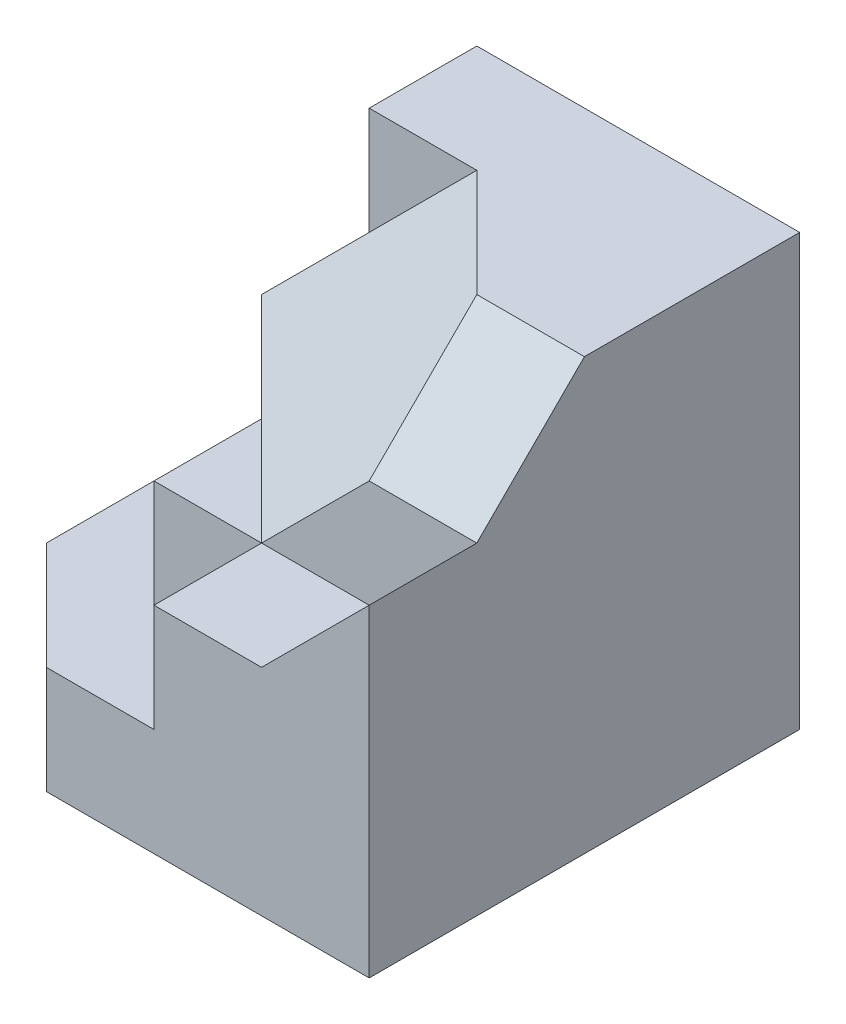
ISO-10303-21;
HEADER;
FILE_DESCRIPTION(('STEP AP214'),'2;1');
FILE_NAME('part.step','',(''),(''),'','','');
FILE_SCHEMA(('AUTOMOTIVE_DESIGN { 1 0 10303 214 1 1 1 1 }'));
ENDSEC;
DATA;
#1=APPLICATION_CONTEXT('core data for automotive mechanical design processes');
#2=APPLICATION_PROTOCOL_DEFINITION('international standard','automotive_design',2000,#1);
#3=PRODUCT_CONTEXT('',#1,'mechanical');
#4=PRODUCT('Part','Part','',(#3));
#5=PRODUCT_RELATED_PRODUCT_CATEGORY('part','',(#4));
#6=PRODUCT_DEFINITION_FORMATION('','',#4);
#7=PRODUCT_DEFINITION_CONTEXT('part definition',#1,'design');
#8=PRODUCT_DEFINITION('design','',#6,#7);
#9=PRODUCT_DEFINITION_SHAPE('','',#8);
#10=(LENGTH_UNIT() NAMED_UNIT(*) SI_UNIT(.MILLI.,.METRE.));
#11=(NAMED_UNIT(*) PLANE_ANGLE_UNIT() SI_UNIT($,.RADIAN.));
#12=(NAMED_UNIT(*) SI_UNIT($,.STERADIAN.) SOLID_ANGLE_UNIT());
#13=UNCERTAINTY_MEASURE_WITH_UNIT(LENGTH_MEASURE(1.E-05),#10,'distance_accuracy_value','');
#14=(GEOMETRIC_REPRESENTATION_CONTEXT(3) GLOBAL_UNCERTAINTY_ASSIGNED_CONTEXT((#13)) GLOBAL_UNIT_ASSIGNED_CONTEXT((#10,
#11,#12)) REPRESENTATION_CONTEXT('',''));
#15=CARTESIAN_POINT('',(0.,0.,0.));
#16=DIRECTION('',(0.,0.,1.));
#17=DIRECTION('',(1.,0.,0.));
#18=AXIS2_PLACEMENT_3D('',#15,#16,#17);
#19=CARTESIAN_POINT('',(0.,0.,5.));
#20=DIRECTION('',(0.,0.,1.));
#21=DIRECTION('',(1.,0.,0.));
#22=AXIS2_PLACEMENT_3D('',#19,#20,#21);
#23=PLANE('',#22);
#24=DIRECTION('',(-1.,0.,0.));
#25=VECTOR('',#24,1.);
#26=CARTESIAN_POINT('',(0.,10.,5.));
#27=LINE('',#26,#25);
#28=CARTESIAN_POINT('',(-13.7914691943128,10.,5.));
#29=VERTEX_POINT('',#28);
#30=CARTESIAN_POINT('',(-18.7914691943128,10.,5.));
#31=VERTEX_POINT('',#30);
#32=EDGE_CURVE('E235',#29,#31,#27,.T.);
#33=ORIENTED_EDGE('',*,*,#32,.F.);
#34=DIRECTION('',(0.707106781186547,0.707106781186548,0.));
#35=VECTOR('',#34,1.);
#36=CARTESIAN_POINT('',(-13.7914691943128,10.0000000000001,5.));
#37=LINE('',#36,#35);
#38=CARTESIAN_POINT('',(-8.79146919431279,15.0000000000001,5.));
#39=VERTEX_POINT('',#38);
#40=EDGE_CURVE('E211',#29,#39,#37,.T.);
#41=ORIENTED_EDGE('',*,*,#40,.T.);
#42=DIRECTION('',(-1.,0.,0.));
#43=VECTOR('',#42,1.);
#44=CARTESIAN_POINT('',(-8.79146919431279,15.0000000000001,5.));
#45=LINE('',#44,#43);
#46=CARTESIAN_POINT('',(-13.7914691943128,15.0000000000001,5.));
#47=VERTEX_POINT('',#46);
#48=EDGE_CURVE('E226',#39,#47,#45,.T.);
#49=ORIENTED_EDGE('',*,*,#48,.T.);
#50=DIRECTION('',(-0.707106781186539,-0.707106781186556,0.));
#51=VECTOR('',#50,1.);
#52=CARTESIAN_POINT('',(-13.7914691943128,15.0000000000001,5.));
#53=LINE('',#52,#51);
#54=EDGE_CURVE('E547',#47,#31,#53,.T.);
#55=ORIENTED_EDGE('',*,*,#54,.T.);
#56=EDGE_LOOP('',(#33,#41,#49,#55));
#57=FACE_BOUND('',#56,.T.);
#58=ADVANCED_FACE('F36',(#57),#23,.T.);
#59=CARTESIAN_POINT('',(-18.7914691943128,20.,5.));
#60=DIRECTION('',(-0.707106781186547,0.,0.707106781186548));
#61=DIRECTION('',(0.707106781186548,0.,0.707106781186547));
#62=AXIS2_PLACEMENT_3D('',#59,#60,#61);
#63=PLANE('',#62);
#64=DIRECTION('',(0.,-1.,0.));
#65=VECTOR('',#64,1.);
#66=CARTESIAN_POINT('',(-23.7914691943128,10.,0.));
#67=LINE('',#66,#65);
#68=CARTESIAN_POINT('',(-23.7914691943128,10.,0.));
#69=VERTEX_POINT('',#68);
#70=CARTESIAN_POINT('',(-23.7914691943128,5.,0.));
#71=VERTEX_POINT('',#70);
#72=EDGE_CURVE('E150',#69,#71,#67,.T.);
#73=ORIENTED_EDGE('',*,*,#72,.F.);
#74=DIRECTION('',(-0.707106781186548,0.,-0.707106781186547));
#75=VECTOR('',#74,1.);
#76=CARTESIAN_POINT('',(-18.7914691943128,10.,5.));
#77=LINE('',#76,#75);
#78=CARTESIAN_POINT('',(-28.7914691943128,10.,-5.));
#79=VERTEX_POINT('',#78);
#80=EDGE_CURVE('E201',#69,#79,#77,.T.);
#81=ORIENTED_EDGE('',*,*,#80,.T.);
#82=DIRECTION('',(0.,1.,0.));
#83=VECTOR('',#82,1.);
#84=CARTESIAN_POINT('',(-28.7914691943128,0.,-5.));
#85=LINE('',#84,#83);
#86=CARTESIAN_POINT('',(-28.7914691943128,5.,-5.));
#87=VERTEX_POINT('',#86);
#88=EDGE_CURVE('E172',#87,#79,#85,.T.);
#89=ORIENTED_EDGE('',*,*,#88,.F.);
#90=DIRECTION('',(0.707106781186548,0.,0.707106781186547));
#91=VECTOR('',#90,1.);
#92=CARTESIAN_POINT('',(-28.7914691943128,5.,-5.));
#93=LINE('',#92,#91);
#94=EDGE_CURVE('E165',#87,#71,#93,.T.);
#95=ORIENTED_EDGE('',*,*,#94,.T.);
#96=EDGE_LOOP('',(#73,#81,#89,#95));
#97=FACE_BOUND('',#96,.T.);
#98=ADVANCED_FACE('F170',(#97),#63,.T.);
#99=CARTESIAN_POINT('',(0.,20.,0.));
#100=DIRECTION('',(0.,-1.,0.));
#101=DIRECTION('',(0.,0.,-1.));
#102=AXIS2_PLACEMENT_3D('',#99,#100,#101);
#103=PLANE('',#102);
#104=DIRECTION('',(-1.,0.,0.));
#105=VECTOR('',#104,1.);
#106=CARTESIAN_POINT('',(0.,20.,-5.));
#107=LINE('',#106,#105);
#108=CARTESIAN_POINT('',(-18.7914691943128,20.,-5.));
#109=VERTEX_POINT('',#108);
#110=CARTESIAN_POINT('',(-23.7914691943128,20.,-5.));
#111=VERTEX_POINT('',#110);
#112=EDGE_CURVE('E206',#109,#111,#107,.T.);
#113=ORIENTED_EDGE('',*,*,#112,.F.);
#114=DIRECTION('',(0.707106781186548,0.,0.707106781186547));
#115=VECTOR('',#114,1.);
#116=CARTESIAN_POINT('',(-18.7914691943128,20.,-5.));
#117=LINE('',#116,#115);
#118=CARTESIAN_POINT('',(-13.7914691943128,20.,0.));
#119=VERTEX_POINT('',#118);
#120=EDGE_CURVE('E196',#109,#119,#117,.T.);
#121=ORIENTED_EDGE('',*,*,#120,.T.);
#122=DIRECTION('',(-1.,0.,0.));
#123=VECTOR('',#122,1.);
#124=CARTESIAN_POINT('',(-8.79146919431279,20.,0.));
#125=LINE('',#124,#123);
#126=CARTESIAN_POINT('',(-8.79146919431279,20.,0.));
#127=VERTEX_POINT('',#126);
#128=EDGE_CURVE('E555',#127,#119,#125,.T.);
#129=ORIENTED_EDGE('',*,*,#128,.F.);
#130=DIRECTION('',(0.,0.,-1.));
#131=VECTOR('',#130,1.);
#132=CARTESIAN_POINT('',(-8.79146919431279,20.,-10.));
#133=LINE('',#132,#131);
#134=CARTESIAN_POINT('',(-8.79146919431279,20.,-10.));
#135=VERTEX_POINT('',#134);
#136=EDGE_CURVE('E320',#127,#135,#133,.T.);
#137=ORIENTED_EDGE('',*,*,#136,.T.);
#138=DIRECTION('',(-1.,0.,0.));
#139=VECTOR('',#138,1.);
#140=CARTESIAN_POINT('',(-23.7914691943128,20.,-10.));
#141=LINE('',#140,#139);
#142=CARTESIAN_POINT('',(-23.7914691943128,20.,-10.));
#143=VERTEX_POINT('',#142);
#144=EDGE_CURVE('E318',#135,#143,#141,.T.);
#145=ORIENTED_EDGE('',*,*,#144,.T.);
#146=DIRECTION('',(0.,0.,1.));
#147=VECTOR('',#146,1.);
#148=CARTESIAN_POINT('',(-23.7914691943128,20.,-5.));
#149=LINE('',#148,#147);
#150=EDGE_CURVE('E317',#143,#111,#149,.T.);
#151=ORIENTED_EDGE('',*,*,#150,.T.);
#152=EDGE_LOOP('',(#113,#121,#129,#137,#145,#151));
#153=FACE_BOUND('',#152,.T.);
#154=ADVANCED_FACE('F333',(#153),#103,.F.);
#155=CARTESIAN_POINT('',(-23.7914691943128,20.,-5.));
#156=DIRECTION('',(1.,0.,0.));
#157=DIRECTION('',(0.,0.,-1.));
#158=AXIS2_PLACEMENT_3D('',#155,#156,#157);
#159=PLANE('',#158);
#160=DIRECTION('',(0.,0.,-1.));
#161=VECTOR('',#160,1.);
#162=CARTESIAN_POINT('',(-23.7914691943128,15.,-10.));
#163=LINE('',#162,#161);
#164=CARTESIAN_POINT('',(-23.7914691943128,15.,-5.));
#165=VERTEX_POINT('',#164);
#166=CARTESIAN_POINT('',(-23.7914691943128,15.,-10.));
#167=VERTEX_POINT('',#166);
#168=EDGE_CURVE('E221',#165,#167,#163,.T.);
#169=ORIENTED_EDGE('',*,*,#168,.F.);
#170=DIRECTION('',(0.,-1.,0.));
#171=VECTOR('',#170,1.);
#172=CARTESIAN_POINT('',(-23.7914691943128,20.,-5.));
#173=LINE('',#172,#171);
#174=EDGE_CURVE('E12',#111,#165,#173,.T.);
#175=ORIENTED_EDGE('',*,*,#174,.F.);
#176=ORIENTED_EDGE('',*,*,#150,.F.);
#177=DIRECTION('',(0.,-1.,0.));
#178=VECTOR('',#177,1.);
#179=CARTESIAN_POINT('',(-23.7914691943128,20.,-10.));
#180=LINE('',#179,#178);
#181=EDGE_CURVE('E300',#143,#167,#180,.T.);
#182=ORIENTED_EDGE('',*,*,#181,.T.);
#183=EDGE_LOOP('',(#169,#175,#176,#182));
#184=FACE_BOUND('',#183,.T.);
#185=ADVANCED_FACE('F38',(#184),#159,.F.);
#186=CARTESIAN_POINT('',(-8.79146919431279,20.,-10.));
#187=DIRECTION('',(-1.,0.,0.));
#188=DIRECTION('',(0.,0.,1.));
#189=AXIS2_PLACEMENT_3D('',#186,#187,#188);
#190=PLANE('',#189);
#191=ORIENTED_EDGE('',*,*,#136,.F.);
#192=DIRECTION('',(0.,-0.707106781186539,0.707106781186556));
#193=VECTOR('',#192,1.);
#194=CARTESIAN_POINT('',(-8.79146919431279,20.,0.));
#195=LINE('',#194,#193);
#196=EDGE_CURVE('E295',#127,#39,#195,.T.);
#197=ORIENTED_EDGE('',*,*,#196,.T.);
#198=DIRECTION('',(0.,0.,-1.));
#199=VECTOR('',#198,1.);
#200=CARTESIAN_POINT('',(-8.79146919431279,15.0000000000001,10.));
#201=LINE('',#200,#199);
#202=CARTESIAN_POINT('',(-8.79146919431279,15.0000000000001,10.));
#203=VERTEX_POINT('',#202);
#204=EDGE_CURVE('E284',#203,#39,#201,.T.);
#205=ORIENTED_EDGE('',*,*,#204,.F.);
#206=DIRECTION('',(0.,1.,0.));
#207=VECTOR('',#206,1.);
#208=CARTESIAN_POINT('',(-8.79146919431279,0.,10.));
#209=LINE('',#208,#207);
#210=CARTESIAN_POINT('',(-8.79146919431279,0.,10.));
#211=VERTEX_POINT('',#210);
#212=EDGE_CURVE('E272',#211,#203,#209,.T.);
#213=ORIENTED_EDGE('',*,*,#212,.F.);
#214=DIRECTION('',(0.,0.,-1.));
#215=VECTOR('',#214,1.);
#216=CARTESIAN_POINT('',(-8.79146919431279,0.,-10.));
#217=LINE('',#216,#215);
#218=CARTESIAN_POINT('',(-8.79146919431279,0.,-10.));
#219=VERTEX_POINT('',#218);
#220=EDGE_CURVE('E281',#211,#219,#217,.T.);
#221=ORIENTED_EDGE('',*,*,#220,.T.);
#222=DIRECTION('',(0.,-1.,0.));
#223=VECTOR('',#222,1.);
#224=CARTESIAN_POINT('',(-8.79146919431279,20.,-10.));
#225=LINE('',#224,#223);
#226=EDGE_CURVE('E45',#135,#219,#225,.T.);
#227=ORIENTED_EDGE('',*,*,#226,.F.);
#228=EDGE_LOOP('',(#191,#197,#205,#213,#221,#227));
#229=FACE_BOUND('',#228,.T.);
#230=ADVANCED_FACE('F279',(#229),#190,.F.);
#231=CARTESIAN_POINT('',(-23.7914691943128,20.,-10.));
#232=DIRECTION('',(0.,0.,1.));
#233=DIRECTION('',(1.,0.,0.));
#234=AXIS2_PLACEMENT_3D('',#231,#232,#233);
#235=PLANE('',#234);
#236=DIRECTION('',(0.,-1.,0.));
#237=VECTOR('',#236,1.);
#238=CARTESIAN_POINT('',(-28.7914691943128,0.,-10.));
#239=LINE('',#238,#237);
#240=CARTESIAN_POINT('',(-28.7914691943128,10.,-10.));
#241=VERTEX_POINT('',#240);
#242=CARTESIAN_POINT('',(-28.7914691943128,0.,-10.));
#243=VERTEX_POINT('',#242);
#244=EDGE_CURVE('E290',#241,#243,#239,.T.);
#245=ORIENTED_EDGE('',*,*,#244,.F.);
#246=DIRECTION('',(0.707106781186548,0.707106781186548,0.));
#247=VECTOR('',#246,1.);
#248=CARTESIAN_POINT('',(-28.7914691943128,10.,-10.));
#249=LINE('',#248,#247);
#250=EDGE_CURVE('E61',#241,#167,#249,.T.);
#251=ORIENTED_EDGE('',*,*,#250,.T.);
#252=ORIENTED_EDGE('',*,*,#181,.F.);
#253=ORIENTED_EDGE('',*,*,#144,.F.);
#254=ORIENTED_EDGE('',*,*,#226,.T.);
#255=DIRECTION('',(-1.,0.,0.));
#256=VECTOR('',#255,1.);
#257=CARTESIAN_POINT('',(-23.7914691943128,0.,-10.));
#258=LINE('',#257,#256);
#259=EDGE_CURVE('E326',#219,#243,#258,.T.);
#260=ORIENTED_EDGE('',*,*,#259,.T.);
#261=EDGE_LOOP('',(#245,#251,#252,#253,#254,#260));
#262=FACE_BOUND('',#261,.T.);
#263=ADVANCED_FACE('F309',(#262),#235,.F.);
#264=CARTESIAN_POINT('',(0.,0.,0.));
#265=DIRECTION('',(0.,-1.,0.));
#266=DIRECTION('',(0.,0.,-1.));
#267=AXIS2_PLACEMENT_3D('',#264,#265,#266);
#268=PLANE('',#267);
#269=DIRECTION('',(-0.707106781186548,0.,-0.707106781186547));
#270=VECTOR('',#269,1.);
#271=CARTESIAN_POINT('',(-23.7914691943128,0.,10.));
#272=LINE('',#271,#270);
#273=CARTESIAN_POINT('',(-23.7914691943128,0.,10.));
#274=VERTEX_POINT('',#273);
#275=CARTESIAN_POINT('',(-28.7914691943128,0.,5.));
#276=VERTEX_POINT('',#275);
#277=EDGE_CURVE('E178',#274,#276,#272,.T.);
#278=ORIENTED_EDGE('',*,*,#277,.T.);
#279=DIRECTION('',(0.,0.,1.));
#280=VECTOR('',#279,1.);
#281=CARTESIAN_POINT('',(-28.7914691943128,0.,-10.));
#282=LINE('',#281,#280);
#283=EDGE_CURVE('E232',#243,#276,#282,.T.);
#284=ORIENTED_EDGE('',*,*,#283,.F.);
#285=ORIENTED_EDGE('',*,*,#259,.F.);
#286=ORIENTED_EDGE('',*,*,#220,.F.);
#287=DIRECTION('',(1.,0.,0.));
#288=VECTOR('',#287,1.);
#289=CARTESIAN_POINT('',(-13.7914691943128,0.,10.));
#290=LINE('',#289,#288);
#291=EDGE_CURVE('E270',#274,#211,#290,.T.);
#292=ORIENTED_EDGE('',*,*,#291,.F.);
#293=EDGE_LOOP('',(#278,#284,#285,#286,#292));
#294=FACE_BOUND('',#293,.T.);
#295=ADVANCED_FACE('F345',(#294),#268,.T.);
#296=CARTESIAN_POINT('',(-8.79146919431279,20.,0.));
#297=DIRECTION('',(0.,-0.707106781186556,-0.707106781186539));
#298=DIRECTION('',(0.,0.707106781186539,-0.707106781186556));
#299=AXIS2_PLACEMENT_3D('',#296,#297,#298);
#300=PLANE('',#299);
#301=DIRECTION('',(0.,-0.707106781186539,0.707106781186556));
#302=VECTOR('',#301,1.);
#303=CARTESIAN_POINT('',(-13.7914691943128,20.,0.));
#304=LINE('',#303,#302);
#305=EDGE_CURVE('E231',#119,#47,#304,.T.);
#306=ORIENTED_EDGE('',*,*,#305,.T.);
#307=ORIENTED_EDGE('',*,*,#48,.F.);
#308=ORIENTED_EDGE('',*,*,#196,.F.);
#309=ORIENTED_EDGE('',*,*,#128,.T.);
#310=EDGE_LOOP('',(#306,#307,#308,#309));
#311=FACE_BOUND('',#310,.T.);
#312=ADVANCED_FACE('F347',(#311),#300,.F.);
#313=CARTESIAN_POINT('',(-28.7914691943128,0.,0.));
#314=DIRECTION('',(1.,0.,0.));
#315=DIRECTION('',(0.,0.,-1.));
#316=AXIS2_PLACEMENT_3D('',#313,#314,#315);
#317=PLANE('',#316);
#318=ORIENTED_EDGE('',*,*,#283,.T.);
#319=DIRECTION('',(0.,-1.,0.));
#320=VECTOR('',#319,1.);
#321=CARTESIAN_POINT('',(-28.7914691943128,5.,5.));
#322=LINE('',#321,#320);
#323=CARTESIAN_POINT('',(-28.7914691943128,5.,5.));
#324=VERTEX_POINT('',#323);
#325=EDGE_CURVE('E188',#324,#276,#322,.T.);
#326=ORIENTED_EDGE('',*,*,#325,.F.);
#327=DIRECTION('',(0.,0.,-1.));
#328=VECTOR('',#327,1.);
#329=CARTESIAN_POINT('',(-28.7914691943128,5.,5.));
#330=LINE('',#329,#328);
#331=EDGE_CURVE('E174',#324,#87,#330,.T.);
#332=ORIENTED_EDGE('',*,*,#331,.T.);
#333=ORIENTED_EDGE('',*,*,#88,.T.);
#334=DIRECTION('',(0.,0.,1.));
#335=VECTOR('',#334,1.);
#336=CARTESIAN_POINT('',(-28.7914691943128,10.,-10.));
#337=LINE('',#336,#335);
#338=EDGE_CURVE('E219',#241,#79,#337,.T.);
#339=ORIENTED_EDGE('',*,*,#338,.F.);
#340=ORIENTED_EDGE('',*,*,#244,.T.);
#341=EDGE_LOOP('',(#318,#326,#332,#333,#339,#340));
#342=FACE_BOUND('',#341,.T.);
#343=ADVANCED_FACE('F344',(#342),#317,.F.);
#344=CARTESIAN_POINT('',(-28.7914691943128,10.,-10.));
#345=DIRECTION('',(0.707106781186548,-0.707106781186548,0.));
#346=DIRECTION('',(0.707106781186548,0.707106781186548,0.));
#347=AXIS2_PLACEMENT_3D('',#344,#345,#346);
#348=PLANE('',#347);
#349=DIRECTION('',(0.707106781186548,0.707106781186548,0.));
#350=VECTOR('',#349,1.);
#351=CARTESIAN_POINT('',(-28.7914691943128,10.,-5.));
#352=LINE('',#351,#350);
#353=EDGE_CURVE('E286',#79,#165,#352,.T.);
#354=ORIENTED_EDGE('',*,*,#353,.T.);
#355=ORIENTED_EDGE('',*,*,#168,.T.);
#356=ORIENTED_EDGE('',*,*,#250,.F.);
#357=ORIENTED_EDGE('',*,*,#338,.T.);
#358=EDGE_LOOP('',(#354,#355,#356,#357));
#359=FACE_BOUND('',#358,.T.);
#360=ADVANCED_FACE('F342',(#359),#348,.F.);
#361=CARTESIAN_POINT('',(0.,0.,10.));
#362=DIRECTION('',(0.,0.,-1.));
#363=DIRECTION('',(-1.,0.,0.));
#364=AXIS2_PLACEMENT_3D('',#361,#362,#363);
#365=PLANE('',#364);
#366=ORIENTED_EDGE('',*,*,#212,.T.);
#367=DIRECTION('',(0.707106781186547,0.707106781186548,0.));
#368=VECTOR('',#367,1.);
#369=CARTESIAN_POINT('',(-13.7914691943128,10.0000000000001,10.));
#370=LINE('',#369,#368);
#371=CARTESIAN_POINT('',(-13.7914691943128,10.,10.));
#372=VERTEX_POINT('',#371);
#373=EDGE_CURVE('E216',#372,#203,#370,.T.);
#374=ORIENTED_EDGE('',*,*,#373,.F.);
#375=DIRECTION('',(1.,0.,0.));
#376=VECTOR('',#375,1.);
#377=CARTESIAN_POINT('',(0.,10.,10.));
#378=LINE('',#377,#376);
#379=CARTESIAN_POINT('',(-18.7914691943128,10.,10.));
#380=VERTEX_POINT('',#379);
#381=EDGE_CURVE('E238',#380,#372,#378,.T.);
#382=ORIENTED_EDGE('',*,*,#381,.F.);
#383=DIRECTION('',(0.,-1.,0.));
#384=VECTOR('',#383,1.);
#385=CARTESIAN_POINT('',(-18.7914691943128,10.,10.));
#386=LINE('',#385,#384);
#387=CARTESIAN_POINT('',(-18.7914691943128,5.,10.));
#388=VERTEX_POINT('',#387);
#389=EDGE_CURVE('E187',#380,#388,#386,.T.);
#390=ORIENTED_EDGE('',*,*,#389,.T.);
#391=DIRECTION('',(-1.,0.,0.));
#392=VECTOR('',#391,1.);
#393=CARTESIAN_POINT('',(-13.7914691943128,5.,10.));
#394=LINE('',#393,#392);
#395=CARTESIAN_POINT('',(-23.7914691943128,5.,10.));
#396=VERTEX_POINT('',#395);
#397=EDGE_CURVE('E173',#388,#396,#394,.T.);
#398=ORIENTED_EDGE('',*,*,#397,.T.);
#399=DIRECTION('',(0.,-1.,0.));
#400=VECTOR('',#399,1.);
#401=CARTESIAN_POINT('',(-23.7914691943128,5.,10.));
#402=LINE('',#401,#400);
#403=EDGE_CURVE('E184',#396,#274,#402,.T.);
#404=ORIENTED_EDGE('',*,*,#403,.T.);
#405=ORIENTED_EDGE('',*,*,#291,.T.);
#406=EDGE_LOOP('',(#366,#374,#382,#390,#398,#404,#405));
#407=FACE_BOUND('',#406,.T.);
#408=ADVANCED_FACE('F261',(#407),#365,.F.);
#409=CARTESIAN_POINT('',(-13.7914691943128,10.0000000000001,5.));
#410=DIRECTION('',(0.707106781186548,-0.707106781186547,0.));
#411=DIRECTION('',(0.707106781186547,0.707106781186548,0.));
#412=AXIS2_PLACEMENT_3D('',#409,#410,#411);
#413=PLANE('',#412);
#414=ORIENTED_EDGE('',*,*,#373,.T.);
#415=ORIENTED_EDGE('',*,*,#204,.T.);
#416=ORIENTED_EDGE('',*,*,#40,.F.);
#417=DIRECTION('',(0.,0.,1.));
#418=VECTOR('',#417,1.);
#419=CARTESIAN_POINT('',(-13.7914691943128,10.0000000000001,5.));
#420=LINE('',#419,#418);
#421=EDGE_CURVE('E275',#29,#372,#420,.T.);
#422=ORIENTED_EDGE('',*,*,#421,.T.);
#423=EDGE_LOOP('',(#414,#415,#416,#422));
#424=FACE_BOUND('',#423,.T.);
#425=ADVANCED_FACE('F367',(#424),#413,.F.);
#426=CARTESIAN_POINT('',(-28.7914691943128,10.,-5.));
#427=DIRECTION('',(0.,0.,1.));
#428=DIRECTION('',(1.,0.,0.));
#429=AXIS2_PLACEMENT_3D('',#426,#427,#428);
#430=PLANE('',#429);
#431=ORIENTED_EDGE('',*,*,#174,.T.);
#432=DIRECTION('',(0.707106781186548,0.707106781186548,0.));
#433=VECTOR('',#432,1.);
#434=CARTESIAN_POINT('',(-28.7914691943128,10.,-5.));
#435=LINE('',#434,#433);
#436=EDGE_CURVE('E191',#165,#109,#435,.T.);
#437=ORIENTED_EDGE('',*,*,#436,.T.);
#438=ORIENTED_EDGE('',*,*,#112,.T.);
#439=EDGE_LOOP('',(#431,#437,#438));
#440=FACE_BOUND('',#439,.T.);
#441=ADVANCED_FACE('F337',(#440),#430,.T.);
#442=CARTESIAN_POINT('',(-11.263823064771,11.263823064771,11.2638230647709));
#443=DIRECTION('',(-0.577350269189628,0.577350269189625,0.577350269189625));
#444=DIRECTION('',(-0.707106781186546,-0.707106781186549,0.));
#445=AXIS2_PLACEMENT_3D('',#442,#443,#444);
#446=PLANE('',#445);
#447=ORIENTED_EDGE('',*,*,#120,.F.);
#448=ORIENTED_EDGE('',*,*,#436,.F.);
#449=ORIENTED_EDGE('',*,*,#353,.F.);
#450=ORIENTED_EDGE('',*,*,#80,.F.);
#451=EDGE_CURVE('E246',#31,#69,#77,.T.);
#452=ORIENTED_EDGE('',*,*,#451,.F.);
#453=ORIENTED_EDGE('',*,*,#54,.F.);
#454=ORIENTED_EDGE('',*,*,#305,.F.);
#455=EDGE_LOOP('',(#447,#448,#449,#450,#452,#453,#454));
#456=FACE_BOUND('',#455,.T.);
#457=ADVANCED_FACE('F341',(#456),#446,.T.);
#458=CARTESIAN_POINT('',(-23.7914691943128,5.,10.));
#459=DIRECTION('',(-0.707106781186547,0.,0.707106781186548));
#460=DIRECTION('',(0.707106781186548,0.,0.707106781186547));
#461=AXIS2_PLACEMENT_3D('',#458,#459,#460);
#462=PLANE('',#461);
#463=ORIENTED_EDGE('',*,*,#277,.F.);
#464=ORIENTED_EDGE('',*,*,#403,.F.);
#465=DIRECTION('',(-0.707106781186548,0.,-0.707106781186547));
#466=VECTOR('',#465,1.);
#467=CARTESIAN_POINT('',(-23.7914691943128,5.,10.));
#468=LINE('',#467,#466);
#469=EDGE_CURVE('E176',#396,#324,#468,.T.);
#470=ORIENTED_EDGE('',*,*,#469,.T.);
#471=ORIENTED_EDGE('',*,*,#325,.T.);
#472=EDGE_LOOP('',(#463,#464,#470,#471));
#473=FACE_BOUND('',#472,.T.);
#474=ADVANCED_FACE('F268',(#473),#462,.T.);
#475=CARTESIAN_POINT('',(0.,5.,0.));
#476=DIRECTION('',(0.,-1.,0.));
#477=DIRECTION('',(0.,0.,-1.));
#478=AXIS2_PLACEMENT_3D('',#475,#476,#477);
#479=PLANE('',#478);
#480=DIRECTION('',(1.,0.,0.));
#481=VECTOR('',#480,1.);
#482=CARTESIAN_POINT('',(0.,5.,5.));
#483=LINE('',#482,#481);
#484=CARTESIAN_POINT('',(-23.7914691943128,5.,5.));
#485=VERTEX_POINT('',#484);
#486=CARTESIAN_POINT('',(-18.7914691943128,5.,5.));
#487=VERTEX_POINT('',#486);
#488=EDGE_CURVE('E160',#485,#487,#483,.T.);
#489=ORIENTED_EDGE('',*,*,#488,.F.);
#490=DIRECTION('',(0.,0.,-1.));
#491=VECTOR('',#490,1.);
#492=CARTESIAN_POINT('',(-23.7914691943128,5.,0.));
#493=LINE('',#492,#491);
#494=EDGE_CURVE('E153',#485,#71,#493,.T.);
#495=ORIENTED_EDGE('',*,*,#494,.T.);
#496=ORIENTED_EDGE('',*,*,#94,.F.);
#497=ORIENTED_EDGE('',*,*,#331,.F.);
#498=ORIENTED_EDGE('',*,*,#469,.F.);
#499=ORIENTED_EDGE('',*,*,#397,.F.);
#500=DIRECTION('',(0.,0.,-1.));
#501=VECTOR('',#500,1.);
#502=CARTESIAN_POINT('',(-18.7914691943128,5.,0.));
#503=LINE('',#502,#501);
#504=EDGE_CURVE('E53',#388,#487,#503,.T.);
#505=ORIENTED_EDGE('',*,*,#504,.T.);
#506=EDGE_LOOP('',(#489,#495,#496,#497,#498,#499,#505));
#507=FACE_BOUND('',#506,.T.);
#508=ADVANCED_FACE('F163',(#507),#479,.F.);
#509=CARTESIAN_POINT('',(-18.7914691943128,10.,0.));
#510=DIRECTION('',(-1.,0.,0.));
#511=DIRECTION('',(0.,0.,1.));
#512=AXIS2_PLACEMENT_3D('',#509,#510,#511);
#513=PLANE('',#512);
#514=ORIENTED_EDGE('',*,*,#504,.F.);
#515=ORIENTED_EDGE('',*,*,#389,.F.);
#516=DIRECTION('',(0.,0.,-1.));
#517=VECTOR('',#516,1.);
#518=CARTESIAN_POINT('',(-18.7914691943128,10.,0.));
#519=LINE('',#518,#517);
#520=EDGE_CURVE('E241',#380,#31,#519,.T.);
#521=ORIENTED_EDGE('',*,*,#520,.T.);
#522=DIRECTION('',(0.,-1.,0.));
#523=VECTOR('',#522,1.);
#524=CARTESIAN_POINT('',(-18.7914691943128,20.,5.));
#525=LINE('',#524,#523);
#526=EDGE_CURVE('E208',#31,#487,#525,.T.);
#527=ORIENTED_EDGE('',*,*,#526,.T.);
#528=EDGE_LOOP('',(#514,#515,#521,#527));
#529=FACE_BOUND('',#528,.T.);
#530=ADVANCED_FACE('F498',(#529),#513,.T.);
#531=CARTESIAN_POINT('',(0.,10.,0.));
#532=DIRECTION('',(0.,1.,0.));
#533=DIRECTION('',(0.,0.,1.));
#534=AXIS2_PLACEMENT_3D('',#531,#532,#533);
#535=PLANE('',#534);
#536=ORIENTED_EDGE('',*,*,#520,.F.);
#537=ORIENTED_EDGE('',*,*,#381,.T.);
#538=ORIENTED_EDGE('',*,*,#421,.F.);
#539=ORIENTED_EDGE('',*,*,#32,.T.);
#540=EDGE_LOOP('',(#536,#537,#538,#539));
#541=FACE_BOUND('',#540,.T.);
#542=ADVANCED_FACE('F506',(#541),#535,.T.);
#543=CARTESIAN_POINT('',(-23.7914691943128,10.,0.));
#544=DIRECTION('',(-1.,0.,0.));
#545=DIRECTION('',(0.,0.,1.));
#546=AXIS2_PLACEMENT_3D('',#543,#544,#545);
#547=PLANE('',#546);
#548=ORIENTED_EDGE('',*,*,#494,.F.);
#549=DIRECTION('',(0.,-1.,0.));
#550=VECTOR('',#549,1.);
#551=CARTESIAN_POINT('',(-23.7914691943128,10.,5.));
#552=LINE('',#551,#550);
#553=CARTESIAN_POINT('',(-23.7914691943128,10.,5.));
#554=VERTEX_POINT('',#553);
#555=EDGE_CURVE('E247',#554,#485,#552,.T.);
#556=ORIENTED_EDGE('',*,*,#555,.F.);
#557=DIRECTION('',(0.,0.,-1.));
#558=VECTOR('',#557,1.);
#559=CARTESIAN_POINT('',(-23.7914691943128,10.,0.));
#560=LINE('',#559,#558);
#561=EDGE_CURVE('E156',#554,#69,#560,.T.);
#562=ORIENTED_EDGE('',*,*,#561,.T.);
#563=ORIENTED_EDGE('',*,*,#72,.T.);
#564=EDGE_LOOP('',(#548,#556,#562,#563));
#565=FACE_BOUND('',#564,.T.);
#566=ADVANCED_FACE('F152',(#565),#547,.T.);
#567=CARTESIAN_POINT('',(0.,10.,5.));
#568=DIRECTION('',(0.,0.,-1.));
#569=DIRECTION('',(-1.,0.,0.));
#570=AXIS2_PLACEMENT_3D('',#567,#568,#569);
#571=PLANE('',#570);
#572=ORIENTED_EDGE('',*,*,#488,.T.);
#573=ORIENTED_EDGE('',*,*,#526,.F.);
#574=DIRECTION('',(1.,0.,0.));
#575=VECTOR('',#574,1.);
#576=CARTESIAN_POINT('',(0.,10.,5.));
#577=LINE('',#576,#575);
#578=EDGE_CURVE('E167',#554,#31,#577,.T.);
#579=ORIENTED_EDGE('',*,*,#578,.F.);
#580=ORIENTED_EDGE('',*,*,#555,.T.);
#581=EDGE_LOOP('',(#572,#573,#579,#580));
#582=FACE_BOUND('',#581,.T.);
#583=ADVANCED_FACE('F524',(#582),#571,.F.);
#584=CARTESIAN_POINT('',(0.,10.,0.));
#585=DIRECTION('',(0.,1.,0.));
#586=DIRECTION('',(0.,0.,1.));
#587=AXIS2_PLACEMENT_3D('',#584,#585,#586);
#588=PLANE('',#587);
#589=ORIENTED_EDGE('',*,*,#561,.F.);
#590=ORIENTED_EDGE('',*,*,#578,.T.);
#591=ORIENTED_EDGE('',*,*,#451,.T.);
#592=EDGE_LOOP('',(#589,#590,#591));
#593=FACE_BOUND('',#592,.T.);
#594=ADVANCED_FACE('F533',(#593),#588,.T.);
#595=CLOSED_SHELL('',(#58,#98,#154,#185,#230,#263,#295,#312,#343,#360,#408,#425,#441,#457,#474,
#508,#530,#542,#566,#583,#594));
#596=MANIFOLD_SOLID_BREP('B2',#595);
#597=ADVANCED_BREP_SHAPE_REPRESENTATION('',(#18,#596),#14);
#598=SHAPE_DEFINITION_REPRESENTATION(#9,#597);
ENDSEC;
END-ISO-10303-21;
